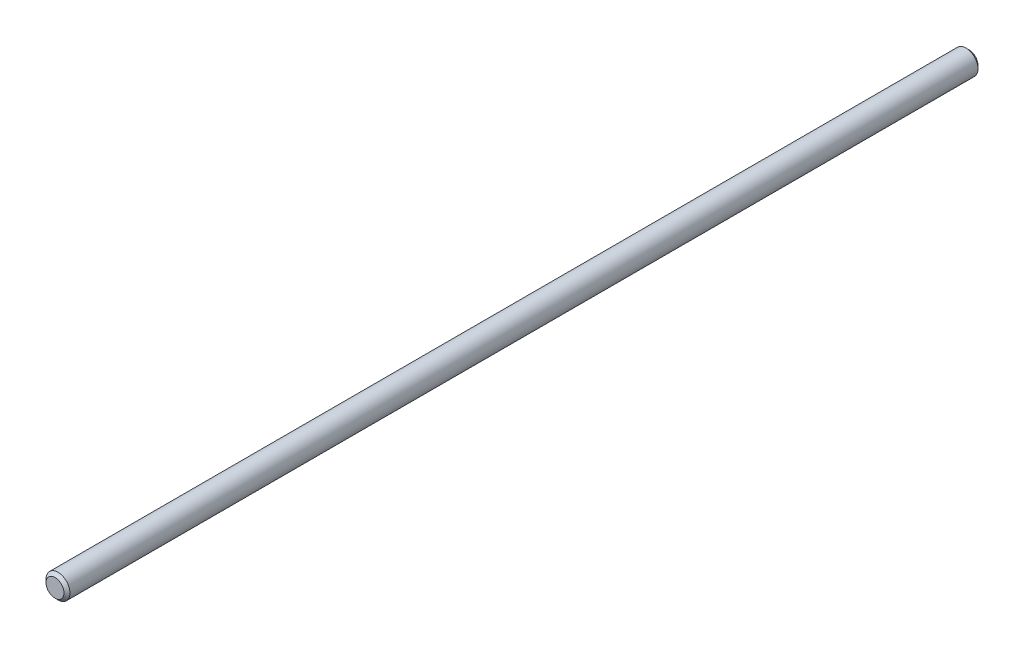
ISO-10303-21;
HEADER;
FILE_DESCRIPTION(('STEP AP214'),'2;1');
FILE_NAME('part.step','',(''),(''),'','','');
FILE_SCHEMA(('AUTOMOTIVE_DESIGN { 1 0 10303 214 1 1 1 1 }'));
ENDSEC;
DATA;
#1=APPLICATION_CONTEXT('core data for automotive mechanical design processes');
#2=APPLICATION_PROTOCOL_DEFINITION('international standard','automotive_design',2000,#1);
#3=PRODUCT_CONTEXT('',#1,'mechanical');
#4=PRODUCT('Part','Part','',(#3));
#5=PRODUCT_RELATED_PRODUCT_CATEGORY('part','',(#4));
#6=PRODUCT_DEFINITION_FORMATION('','',#4);
#7=PRODUCT_DEFINITION_CONTEXT('part definition',#1,'design');
#8=PRODUCT_DEFINITION('design','',#6,#7);
#9=PRODUCT_DEFINITION_SHAPE('','',#8);
#10=(LENGTH_UNIT() NAMED_UNIT(*) SI_UNIT(.MILLI.,.METRE.));
#11=(NAMED_UNIT(*) PLANE_ANGLE_UNIT() SI_UNIT($,.RADIAN.));
#12=(NAMED_UNIT(*) SI_UNIT($,.STERADIAN.) SOLID_ANGLE_UNIT());
#13=UNCERTAINTY_MEASURE_WITH_UNIT(LENGTH_MEASURE(1.E-05),#10,'distance_accuracy_value','');
#14=(GEOMETRIC_REPRESENTATION_CONTEXT(3) GLOBAL_UNCERTAINTY_ASSIGNED_CONTEXT((#13)) GLOBAL_UNIT_ASSIGNED_CONTEXT((#10,
#11,#12)) REPRESENTATION_CONTEXT('',''));
#15=CARTESIAN_POINT('',(0.,0.,0.));
#16=DIRECTION('',(0.,0.,1.));
#17=DIRECTION('',(1.,0.,0.));
#18=AXIS2_PLACEMENT_3D('',#15,#16,#17);
#19=CARTESIAN_POINT('',(0.,0.,305.));
#20=DIRECTION('',(0.,0.,-1.));
#21=DIRECTION('',(-1.,0.,0.));
#22=AXIS2_PLACEMENT_3D('',#19,#20,#21);
#23=CYLINDRICAL_SURFACE('',#22,4.);
#24=CARTESIAN_POINT('',(0.,0.,304.));
#25=DIRECTION('',(0.,0.,1.));
#26=DIRECTION('',(1.,0.,0.));
#27=AXIS2_PLACEMENT_3D('',#24,#25,#26);
#28=CIRCLE('',#27,4.);
#29=CARTESIAN_POINT('',(4.,0.,304.));
#30=VERTEX_POINT('',#29);
#31=EDGE_CURVE('E10',#30,#30,#28,.F.);
#32=ORIENTED_EDGE('',*,*,#31,.T.);
#33=EDGE_LOOP('',(#32));
#34=FACE_BOUND('',#33,.T.);
#35=CARTESIAN_POINT('',(0.,0.,0.999999999999945));
#36=DIRECTION('',(0.,0.,1.));
#37=DIRECTION('',(1.,0.,0.));
#38=AXIS2_PLACEMENT_3D('',#35,#36,#37);
#39=CIRCLE('',#38,4.);
#40=CARTESIAN_POINT('',(4.,0.,0.999999999999945));
#41=VERTEX_POINT('',#40);
#42=EDGE_CURVE('E46',#41,#41,#39,.T.);
#43=ORIENTED_EDGE('',*,*,#42,.T.);
#44=EDGE_LOOP('',(#43));
#45=FACE_BOUND('',#44,.T.);
#46=ADVANCED_FACE('F31',(#34,#45),#23,.T.);
#47=CARTESIAN_POINT('',(0.,0.,305.));
#48=DIRECTION('',(0.,0.,1.));
#49=DIRECTION('',(1.,0.,0.));
#50=AXIS2_PLACEMENT_3D('',#47,#48,#49);
#51=PLANE('',#50);
#52=CARTESIAN_POINT('',(0.,0.,305.));
#53=DIRECTION('',(0.,0.,1.));
#54=DIRECTION('',(1.,0.,0.));
#55=AXIS2_PLACEMENT_3D('',#52,#53,#54);
#56=CIRCLE('',#55,3.);
#57=CARTESIAN_POINT('',(3.,0.,305.));
#58=VERTEX_POINT('',#57);
#59=EDGE_CURVE('E38',#58,#58,#56,.T.);
#60=ORIENTED_EDGE('',*,*,#59,.T.);
#61=EDGE_LOOP('',(#60));
#62=FACE_BOUND('',#61,.T.);
#63=ADVANCED_FACE('F62',(#62),#51,.T.);
#64=CARTESIAN_POINT('',(0.,0.,0.));
#65=DIRECTION('',(0.,0.,1.));
#66=DIRECTION('',(1.,0.,0.));
#67=AXIS2_PLACEMENT_3D('',#64,#65,#66);
#68=PLANE('',#67);
#69=CARTESIAN_POINT('',(0.,0.,0.));
#70=DIRECTION('',(0.,0.,1.));
#71=DIRECTION('',(1.,0.,0.));
#72=AXIS2_PLACEMENT_3D('',#69,#70,#71);
#73=CIRCLE('',#72,3.00000000000003);
#74=CARTESIAN_POINT('',(3.00000000000003,0.,0.));
#75=VERTEX_POINT('',#74);
#76=EDGE_CURVE('E42',#75,#75,#73,.F.);
#77=ORIENTED_EDGE('',*,*,#76,.T.);
#78=EDGE_LOOP('',(#77));
#79=FACE_BOUND('',#78,.T.);
#80=ADVANCED_FACE('F55',(#79),#68,.F.);
#81=CARTESIAN_POINT('',(0.,0.,0.999999999999945));
#82=DIRECTION('',(0.,0.,1.));
#83=DIRECTION('',(1.,0.,0.));
#84=AXIS2_PLACEMENT_3D('',#81,#82,#83);
#85=CONICAL_SURFACE('',#84,4.,0.78539816339746);
#86=ORIENTED_EDGE('',*,*,#76,.F.);
#87=EDGE_LOOP('',(#86));
#88=FACE_BOUND('',#87,.T.);
#89=ORIENTED_EDGE('',*,*,#42,.F.);
#90=EDGE_LOOP('',(#89));
#91=FACE_BOUND('',#90,.T.);
#92=ADVANCED_FACE('F53',(#88,#91),#85,.T.);
#93=CARTESIAN_POINT('',(0.,0.,305.));
#94=DIRECTION('',(0.,0.,-1.));
#95=DIRECTION('',(-1.,0.,0.));
#96=AXIS2_PLACEMENT_3D('',#93,#94,#95);
#97=CONICAL_SURFACE('',#96,3.,0.785398163397447);
#98=ORIENTED_EDGE('',*,*,#31,.F.);
#99=EDGE_LOOP('',(#98));
#100=FACE_BOUND('',#99,.T.);
#101=ORIENTED_EDGE('',*,*,#59,.F.);
#102=EDGE_LOOP('',(#101));
#103=FACE_BOUND('',#102,.T.);
#104=ADVANCED_FACE('F33',(#100,#103),#97,.T.);
#105=CLOSED_SHELL('',(#46,#63,#80,#92,#104));
#106=MANIFOLD_SOLID_BREP('B2',#105);
#107=ADVANCED_BREP_SHAPE_REPRESENTATION('',(#18,#106),#14);
#108=SHAPE_DEFINITION_REPRESENTATION(#9,#107);
ENDSEC;
END-ISO-10303-21;
